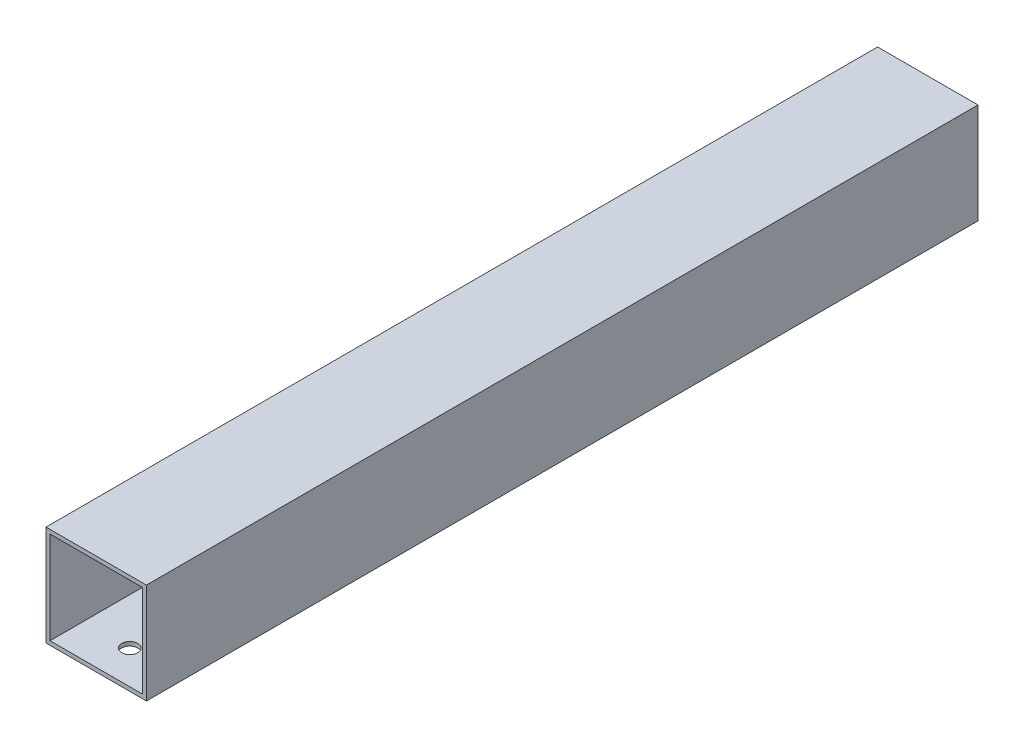
ISO-10303-21;
HEADER;
FILE_DESCRIPTION(('STEP AP214'),'2;1');
FILE_NAME('part.step','',(''),(''),'','','');
FILE_SCHEMA(('AUTOMOTIVE_DESIGN { 1 0 10303 214 1 1 1 1 }'));
ENDSEC;
DATA;
#1=APPLICATION_CONTEXT('core data for automotive mechanical design processes');
#2=APPLICATION_PROTOCOL_DEFINITION('international standard','automotive_design',2000,#1);
#3=PRODUCT_CONTEXT('',#1,'mechanical');
#4=PRODUCT('Part','Part','',(#3));
#5=PRODUCT_RELATED_PRODUCT_CATEGORY('part','',(#4));
#6=PRODUCT_DEFINITION_FORMATION('','',#4);
#7=PRODUCT_DEFINITION_CONTEXT('part definition',#1,'design');
#8=PRODUCT_DEFINITION('design','',#6,#7);
#9=PRODUCT_DEFINITION_SHAPE('','',#8);
#10=(LENGTH_UNIT() NAMED_UNIT(*) SI_UNIT(.MILLI.,.METRE.));
#11=(NAMED_UNIT(*) PLANE_ANGLE_UNIT() SI_UNIT($,.RADIAN.));
#12=(NAMED_UNIT(*) SI_UNIT($,.STERADIAN.) SOLID_ANGLE_UNIT());
#13=UNCERTAINTY_MEASURE_WITH_UNIT(LENGTH_MEASURE(1.E-05),#10,'distance_accuracy_value','');
#14=(GEOMETRIC_REPRESENTATION_CONTEXT(3) GLOBAL_UNCERTAINTY_ASSIGNED_CONTEXT((#13)) GLOBAL_UNIT_ASSIGNED_CONTEXT((#10,
#11,#12)) REPRESENTATION_CONTEXT('',''));
#15=CARTESIAN_POINT('',(0.,0.,0.));
#16=DIRECTION('',(0.,0.,1.));
#17=DIRECTION('',(1.,0.,0.));
#18=AXIS2_PLACEMENT_3D('',#15,#16,#17);
#19=CARTESIAN_POINT('',(0.,0.,414.));
#20=DIRECTION('',(0.,0.,1.));
#21=DIRECTION('',(1.,0.,0.));
#22=AXIS2_PLACEMENT_3D('',#19,#20,#21);
#23=PLANE('',#22);
#24=DIRECTION('',(0.,1.,0.));
#25=VECTOR('',#24,1.);
#26=CARTESIAN_POINT('',(2.,-2.,414.));
#27=LINE('',#26,#25);
#28=CARTESIAN_POINT('',(2.,-2.,414.));
#29=VERTEX_POINT('',#28);
#30=CARTESIAN_POINT('',(2.,48.,414.));
#31=VERTEX_POINT('',#30);
#32=EDGE_CURVE('E155',#29,#31,#27,.T.);
#33=ORIENTED_EDGE('',*,*,#32,.T.);
#34=DIRECTION('',(-1.,0.,0.));
#35=VECTOR('',#34,1.);
#36=CARTESIAN_POINT('',(2.,48.,414.));
#37=LINE('',#36,#35);
#38=CARTESIAN_POINT('',(-48.,48.,414.));
#39=VERTEX_POINT('',#38);
#40=EDGE_CURVE('E159',#31,#39,#37,.T.);
#41=ORIENTED_EDGE('',*,*,#40,.T.);
#42=DIRECTION('',(0.,-1.,0.));
#43=VECTOR('',#42,1.);
#44=CARTESIAN_POINT('',(-48.,-2.00000000000001,414.));
#45=LINE('',#44,#43);
#46=CARTESIAN_POINT('',(-48.,-2.00000000000001,414.));
#47=VERTEX_POINT('',#46);
#48=EDGE_CURVE('E163',#39,#47,#45,.T.);
#49=ORIENTED_EDGE('',*,*,#48,.T.);
#50=DIRECTION('',(1.,0.,0.));
#51=VECTOR('',#50,1.);
#52=CARTESIAN_POINT('',(2.,-2.,414.));
#53=LINE('',#52,#51);
#54=EDGE_CURVE('E166',#47,#29,#53,.T.);
#55=ORIENTED_EDGE('',*,*,#54,.T.);
#56=EDGE_LOOP('',(#33,#41,#49,#55));
#57=FACE_BOUND('',#56,.T.);
#58=DIRECTION('',(-1.,0.,0.));
#59=VECTOR('',#58,1.);
#60=CARTESIAN_POINT('',(0.,46.,414.));
#61=LINE('',#60,#59);
#62=CARTESIAN_POINT('',(0.,46.,414.));
#63=VERTEX_POINT('',#62);
#64=CARTESIAN_POINT('',(-46.,46.,414.));
#65=VERTEX_POINT('',#64);
#66=EDGE_CURVE('E114',#63,#65,#61,.T.);
#67=ORIENTED_EDGE('',*,*,#66,.F.);
#68=DIRECTION('',(0.,1.,0.));
#69=VECTOR('',#68,1.);
#70=CARTESIAN_POINT('',(0.,0.,414.));
#71=LINE('',#70,#69);
#72=CARTESIAN_POINT('',(0.,0.,414.));
#73=VERTEX_POINT('',#72);
#74=EDGE_CURVE('E105',#73,#63,#71,.T.);
#75=ORIENTED_EDGE('',*,*,#74,.F.);
#76=DIRECTION('',(1.,0.,0.));
#77=VECTOR('',#76,1.);
#78=CARTESIAN_POINT('',(0.,0.,414.));
#79=LINE('',#78,#77);
#80=CARTESIAN_POINT('',(-46.,0.,414.));
#81=VERTEX_POINT('',#80);
#82=EDGE_CURVE('E131',#81,#73,#79,.T.);
#83=ORIENTED_EDGE('',*,*,#82,.F.);
#84=DIRECTION('',(0.,-1.,0.));
#85=VECTOR('',#84,1.);
#86=CARTESIAN_POINT('',(-46.,0.,414.));
#87=LINE('',#86,#85);
#88=EDGE_CURVE('E127',#65,#81,#87,.T.);
#89=ORIENTED_EDGE('',*,*,#88,.F.);
#90=EDGE_LOOP('',(#67,#75,#83,#89));
#91=FACE_BOUND('',#90,.T.);
#92=ADVANCED_FACE('F39',(#57,#91),#23,.T.);
#93=CARTESIAN_POINT('',(0.,0.,0.));
#94=DIRECTION('',(0.,0.,1.));
#95=DIRECTION('',(1.,0.,0.));
#96=AXIS2_PLACEMENT_3D('',#93,#94,#95);
#97=PLANE('',#96);
#98=DIRECTION('',(0.,1.,0.));
#99=VECTOR('',#98,1.);
#100=CARTESIAN_POINT('',(2.,-2.,0.));
#101=LINE('',#100,#99);
#102=CARTESIAN_POINT('',(2.,-2.,0.));
#103=VERTEX_POINT('',#102);
#104=CARTESIAN_POINT('',(2.,48.,0.));
#105=VERTEX_POINT('',#104);
#106=EDGE_CURVE('E123',#103,#105,#101,.T.);
#107=ORIENTED_EDGE('',*,*,#106,.F.);
#108=DIRECTION('',(1.,0.,0.));
#109=VECTOR('',#108,1.);
#110=CARTESIAN_POINT('',(2.,-2.,0.));
#111=LINE('',#110,#109);
#112=CARTESIAN_POINT('',(-48.,-2.00000000000001,0.));
#113=VERTEX_POINT('',#112);
#114=EDGE_CURVE('E160',#113,#103,#111,.T.);
#115=ORIENTED_EDGE('',*,*,#114,.F.);
#116=DIRECTION('',(0.,-1.,0.));
#117=VECTOR('',#116,1.);
#118=CARTESIAN_POINT('',(-48.,-2.00000000000001,0.));
#119=LINE('',#118,#117);
#120=CARTESIAN_POINT('',(-48.,48.,0.));
#121=VERTEX_POINT('',#120);
#122=EDGE_CURVE('E176',#121,#113,#119,.T.);
#123=ORIENTED_EDGE('',*,*,#122,.F.);
#124=DIRECTION('',(-1.,0.,0.));
#125=VECTOR('',#124,1.);
#126=CARTESIAN_POINT('',(2.,48.,0.));
#127=LINE('',#126,#125);
#128=EDGE_CURVE('E173',#105,#121,#127,.T.);
#129=ORIENTED_EDGE('',*,*,#128,.F.);
#130=EDGE_LOOP('',(#107,#115,#123,#129));
#131=FACE_BOUND('',#130,.T.);
#132=DIRECTION('',(0.,1.,0.));
#133=VECTOR('',#132,1.);
#134=CARTESIAN_POINT('',(0.,0.,0.));
#135=LINE('',#134,#133);
#136=CARTESIAN_POINT('',(0.,0.,0.));
#137=VERTEX_POINT('',#136);
#138=CARTESIAN_POINT('',(0.,46.,0.));
#139=VERTEX_POINT('',#138);
#140=EDGE_CURVE('E63',#137,#139,#135,.T.);
#141=ORIENTED_EDGE('',*,*,#140,.T.);
#142=DIRECTION('',(-1.,0.,0.));
#143=VECTOR('',#142,1.);
#144=CARTESIAN_POINT('',(0.,46.,0.));
#145=LINE('',#144,#143);
#146=CARTESIAN_POINT('',(-46.,46.,0.));
#147=VERTEX_POINT('',#146);
#148=EDGE_CURVE('E121',#139,#147,#145,.T.);
#149=ORIENTED_EDGE('',*,*,#148,.T.);
#150=DIRECTION('',(0.,-1.,0.));
#151=VECTOR('',#150,1.);
#152=CARTESIAN_POINT('',(-46.,0.,0.));
#153=LINE('',#152,#151);
#154=CARTESIAN_POINT('',(-46.,0.,0.));
#155=VERTEX_POINT('',#154);
#156=EDGE_CURVE('E142',#147,#155,#153,.T.);
#157=ORIENTED_EDGE('',*,*,#156,.T.);
#158=DIRECTION('',(1.,0.,0.));
#159=VECTOR('',#158,1.);
#160=CARTESIAN_POINT('',(0.,0.,0.));
#161=LINE('',#160,#159);
#162=EDGE_CURVE('E115',#155,#137,#161,.T.);
#163=ORIENTED_EDGE('',*,*,#162,.T.);
#164=EDGE_LOOP('',(#141,#149,#157,#163));
#165=FACE_BOUND('',#164,.T.);
#166=ADVANCED_FACE('F199',(#131,#165),#97,.F.);
#167=CARTESIAN_POINT('',(2.,-2.,414.));
#168=DIRECTION('',(-1.,0.,0.));
#169=DIRECTION('',(0.,0.,1.));
#170=AXIS2_PLACEMENT_3D('',#167,#168,#169);
#171=PLANE('',#170);
#172=ORIENTED_EDGE('',*,*,#106,.T.);
#173=DIRECTION('',(0.,0.,-1.));
#174=VECTOR('',#173,1.);
#175=CARTESIAN_POINT('',(2.,48.,414.));
#176=LINE('',#175,#174);
#177=EDGE_CURVE('E11',#31,#105,#176,.T.);
#178=ORIENTED_EDGE('',*,*,#177,.F.);
#179=ORIENTED_EDGE('',*,*,#32,.F.);
#180=DIRECTION('',(0.,0.,-1.));
#181=VECTOR('',#180,1.);
#182=CARTESIAN_POINT('',(2.,-2.,414.));
#183=LINE('',#182,#181);
#184=EDGE_CURVE('E169',#29,#103,#183,.T.);
#185=ORIENTED_EDGE('',*,*,#184,.T.);
#186=EDGE_LOOP('',(#172,#178,#179,#185));
#187=FACE_BOUND('',#186,.T.);
#188=ADVANCED_FACE('F41',(#187),#171,.F.);
#189=CARTESIAN_POINT('',(2.,48.,414.));
#190=DIRECTION('',(0.,-1.,0.));
#191=DIRECTION('',(1.,0.,0.));
#192=AXIS2_PLACEMENT_3D('',#189,#190,#191);
#193=PLANE('',#192);
#194=ORIENTED_EDGE('',*,*,#128,.T.);
#195=DIRECTION('',(0.,0.,-1.));
#196=VECTOR('',#195,1.);
#197=CARTESIAN_POINT('',(-48.,48.,414.));
#198=LINE('',#197,#196);
#199=EDGE_CURVE('E48',#39,#121,#198,.T.);
#200=ORIENTED_EDGE('',*,*,#199,.F.);
#201=ORIENTED_EDGE('',*,*,#40,.F.);
#202=ORIENTED_EDGE('',*,*,#177,.T.);
#203=EDGE_LOOP('',(#194,#200,#201,#202));
#204=FACE_BOUND('',#203,.T.);
#205=ADVANCED_FACE('F209',(#204),#193,.F.);
#206=CARTESIAN_POINT('',(-48.,-2.00000000000001,414.));
#207=DIRECTION('',(1.,0.,0.));
#208=DIRECTION('',(0.,0.,-1.));
#209=AXIS2_PLACEMENT_3D('',#206,#207,#208);
#210=PLANE('',#209);
#211=ORIENTED_EDGE('',*,*,#122,.T.);
#212=DIRECTION('',(0.,0.,-1.));
#213=VECTOR('',#212,1.);
#214=CARTESIAN_POINT('',(-48.,-2.00000000000001,414.));
#215=LINE('',#214,#213);
#216=EDGE_CURVE('E184',#47,#113,#215,.T.);
#217=ORIENTED_EDGE('',*,*,#216,.F.);
#218=ORIENTED_EDGE('',*,*,#48,.F.);
#219=ORIENTED_EDGE('',*,*,#199,.T.);
#220=EDGE_LOOP('',(#211,#217,#218,#219));
#221=FACE_BOUND('',#220,.T.);
#222=ADVANCED_FACE('F193',(#221),#210,.F.);
#223=CARTESIAN_POINT('',(2.,-2.,414.));
#224=DIRECTION('',(0.,1.,0.));
#225=DIRECTION('',(-1.,0.,0.));
#226=AXIS2_PLACEMENT_3D('',#223,#224,#225);
#227=PLANE('',#226);
#228=CARTESIAN_POINT('',(-22.9999999997553,-2.,397.3));
#229=DIRECTION('',(0.,-1.,0.));
#230=DIRECTION('',(1.,0.,0.));
#231=AXIS2_PLACEMENT_3D('',#228,#229,#230);
#232=CIRCLE('',#231,4.);
#233=CARTESIAN_POINT('',(-18.9999999997553,-2.,397.3));
#234=VERTEX_POINT('',#233);
#235=EDGE_CURVE('E235',#234,#234,#232,.T.);
#236=ORIENTED_EDGE('',*,*,#235,.F.);
#237=EDGE_LOOP('',(#236));
#238=FACE_BOUND('',#237,.T.);
#239=CARTESIAN_POINT('',(-22.9999999997553,-2.,50.3));
#240=DIRECTION('',(0.,-1.,0.));
#241=DIRECTION('',(1.,0.,0.));
#242=AXIS2_PLACEMENT_3D('',#239,#240,#241);
#243=CIRCLE('',#242,3.99999999976597);
#244=CARTESIAN_POINT('',(-18.9999999999893,-2.,50.3));
#245=VERTEX_POINT('',#244);
#246=EDGE_CURVE('E238',#245,#245,#243,.T.);
#247=ORIENTED_EDGE('',*,*,#246,.F.);
#248=EDGE_LOOP('',(#247));
#249=FACE_BOUND('',#248,.T.);
#250=ORIENTED_EDGE('',*,*,#114,.T.);
#251=ORIENTED_EDGE('',*,*,#184,.F.);
#252=ORIENTED_EDGE('',*,*,#54,.F.);
#253=ORIENTED_EDGE('',*,*,#216,.T.);
#254=EDGE_LOOP('',(#250,#251,#252,#253));
#255=FACE_BOUND('',#254,.T.);
#256=ADVANCED_FACE('F203',(#238,#249,#255),#227,.F.);
#257=CARTESIAN_POINT('',(0.,0.,414.));
#258=DIRECTION('',(-1.,0.,0.));
#259=DIRECTION('',(0.,0.,1.));
#260=AXIS2_PLACEMENT_3D('',#257,#258,#259);
#261=PLANE('',#260);
#262=ORIENTED_EDGE('',*,*,#140,.F.);
#263=DIRECTION('',(0.,0.,-1.));
#264=VECTOR('',#263,1.);
#265=CARTESIAN_POINT('',(0.,0.,414.));
#266=LINE('',#265,#264);
#267=EDGE_CURVE('E109',#73,#137,#266,.T.);
#268=ORIENTED_EDGE('',*,*,#267,.F.);
#269=ORIENTED_EDGE('',*,*,#74,.T.);
#270=DIRECTION('',(0.,0.,-1.));
#271=VECTOR('',#270,1.);
#272=CARTESIAN_POINT('',(0.,46.,414.));
#273=LINE('',#272,#271);
#274=EDGE_CURVE('E108',#63,#139,#273,.T.);
#275=ORIENTED_EDGE('',*,*,#274,.T.);
#276=EDGE_LOOP('',(#262,#268,#269,#275));
#277=FACE_BOUND('',#276,.T.);
#278=ADVANCED_FACE('F107',(#277),#261,.T.);
#279=CARTESIAN_POINT('',(0.,46.,414.));
#280=DIRECTION('',(0.,-1.,0.));
#281=DIRECTION('',(1.,0.,0.));
#282=AXIS2_PLACEMENT_3D('',#279,#280,#281);
#283=PLANE('',#282);
#284=ORIENTED_EDGE('',*,*,#148,.F.);
#285=ORIENTED_EDGE('',*,*,#274,.F.);
#286=ORIENTED_EDGE('',*,*,#66,.T.);
#287=DIRECTION('',(0.,0.,-1.));
#288=VECTOR('',#287,1.);
#289=CARTESIAN_POINT('',(-46.,46.,414.));
#290=LINE('',#289,#288);
#291=EDGE_CURVE('E124',#65,#147,#290,.T.);
#292=ORIENTED_EDGE('',*,*,#291,.T.);
#293=EDGE_LOOP('',(#284,#285,#286,#292));
#294=FACE_BOUND('',#293,.T.);
#295=ADVANCED_FACE('F118',(#294),#283,.T.);
#296=CARTESIAN_POINT('',(-46.,0.,414.));
#297=DIRECTION('',(1.,0.,0.));
#298=DIRECTION('',(0.,0.,-1.));
#299=AXIS2_PLACEMENT_3D('',#296,#297,#298);
#300=PLANE('',#299);
#301=ORIENTED_EDGE('',*,*,#156,.F.);
#302=ORIENTED_EDGE('',*,*,#291,.F.);
#303=ORIENTED_EDGE('',*,*,#88,.T.);
#304=DIRECTION('',(0.,0.,-1.));
#305=VECTOR('',#304,1.);
#306=CARTESIAN_POINT('',(-46.,0.,414.));
#307=LINE('',#306,#305);
#308=EDGE_CURVE('E55',#81,#155,#307,.T.);
#309=ORIENTED_EDGE('',*,*,#308,.T.);
#310=EDGE_LOOP('',(#301,#302,#303,#309));
#311=FACE_BOUND('',#310,.T.);
#312=ADVANCED_FACE('F265',(#311),#300,.T.);
#313=CARTESIAN_POINT('',(0.,0.,414.));
#314=DIRECTION('',(0.,1.,0.));
#315=DIRECTION('',(-1.,0.,0.));
#316=AXIS2_PLACEMENT_3D('',#313,#314,#315);
#317=PLANE('',#316);
#318=CARTESIAN_POINT('',(-22.9999999997553,0.,397.3));
#319=DIRECTION('',(0.,-1.,0.));
#320=DIRECTION('',(1.,0.,0.));
#321=AXIS2_PLACEMENT_3D('',#318,#319,#320);
#322=CIRCLE('',#321,4.);
#323=CARTESIAN_POINT('',(-18.9999999997553,0.,397.3));
#324=VERTEX_POINT('',#323);
#325=EDGE_CURVE('E241',#324,#324,#322,.T.);
#326=ORIENTED_EDGE('',*,*,#325,.T.);
#327=EDGE_LOOP('',(#326));
#328=FACE_BOUND('',#327,.T.);
#329=CARTESIAN_POINT('',(-22.9999999997553,0.,50.3));
#330=DIRECTION('',(0.,-1.,0.));
#331=DIRECTION('',(1.,0.,0.));
#332=AXIS2_PLACEMENT_3D('',#329,#330,#331);
#333=CIRCLE('',#332,3.99999999976597);
#334=CARTESIAN_POINT('',(-18.9999999999893,0.,50.3));
#335=VERTEX_POINT('',#334);
#336=EDGE_CURVE('E139',#335,#335,#333,.T.);
#337=ORIENTED_EDGE('',*,*,#336,.T.);
#338=EDGE_LOOP('',(#337));
#339=FACE_BOUND('',#338,.T.);
#340=ORIENTED_EDGE('',*,*,#162,.F.);
#341=ORIENTED_EDGE('',*,*,#308,.F.);
#342=ORIENTED_EDGE('',*,*,#82,.T.);
#343=ORIENTED_EDGE('',*,*,#267,.T.);
#344=EDGE_LOOP('',(#340,#341,#342,#343));
#345=FACE_BOUND('',#344,.T.);
#346=ADVANCED_FACE('F259',(#328,#339,#345),#317,.T.);
#347=CARTESIAN_POINT('',(-22.9999999997553,0.,50.3));
#348=DIRECTION('',(0.,-1.,0.));
#349=DIRECTION('',(1.,0.,0.));
#350=AXIS2_PLACEMENT_3D('',#347,#348,#349);
#351=CYLINDRICAL_SURFACE('',#350,3.99999999976597);
#352=ORIENTED_EDGE('',*,*,#336,.F.);
#353=EDGE_LOOP('',(#352));
#354=FACE_BOUND('',#353,.T.);
#355=ORIENTED_EDGE('',*,*,#246,.T.);
#356=EDGE_LOOP('',(#355));
#357=FACE_BOUND('',#356,.T.);
#358=ADVANCED_FACE('F253',(#354,#357),#351,.F.);
#359=CARTESIAN_POINT('',(-22.9999999997553,0.,397.3));
#360=DIRECTION('',(0.,-1.,0.));
#361=DIRECTION('',(1.,0.,0.));
#362=AXIS2_PLACEMENT_3D('',#359,#360,#361);
#363=CYLINDRICAL_SURFACE('',#362,4.);
#364=ORIENTED_EDGE('',*,*,#325,.F.);
#365=EDGE_LOOP('',(#364));
#366=FACE_BOUND('',#365,.T.);
#367=ORIENTED_EDGE('',*,*,#235,.T.);
#368=EDGE_LOOP('',(#367));
#369=FACE_BOUND('',#368,.T.);
#370=ADVANCED_FACE('F251',(#366,#369),#363,.F.);
#371=CLOSED_SHELL('',(#92,#166,#188,#205,#222,#256,#278,#295,#312,#346,#358,#370));
#372=MANIFOLD_SOLID_BREP('B2',#371);
#373=ADVANCED_BREP_SHAPE_REPRESENTATION('',(#18,#372),#14);
#374=SHAPE_DEFINITION_REPRESENTATION(#9,#373);
ENDSEC;
END-ISO-10303-21;
